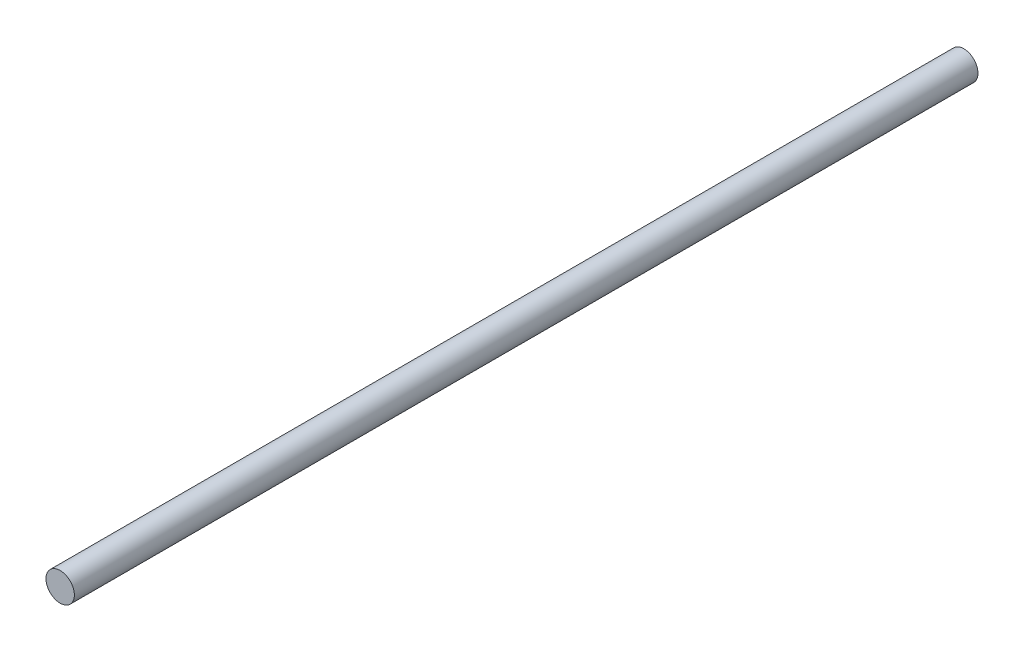
ISO-10303-21;
HEADER;
FILE_DESCRIPTION(('STEP AP214'),'2;1');
FILE_NAME('part.step','',(''),(''),'','','');
FILE_SCHEMA(('AUTOMOTIVE_DESIGN { 1 0 10303 214 1 1 1 1 }'));
ENDSEC;
DATA;
#1=APPLICATION_CONTEXT('core data for automotive mechanical design processes');
#2=APPLICATION_PROTOCOL_DEFINITION('international standard','automotive_design',2000,#1);
#3=PRODUCT_CONTEXT('',#1,'mechanical');
#4=PRODUCT('Part','Part','',(#3));
#5=PRODUCT_RELATED_PRODUCT_CATEGORY('part','',(#4));
#6=PRODUCT_DEFINITION_FORMATION('','',#4);
#7=PRODUCT_DEFINITION_CONTEXT('part definition',#1,'design');
#8=PRODUCT_DEFINITION('design','',#6,#7);
#9=PRODUCT_DEFINITION_SHAPE('','',#8);
#10=(LENGTH_UNIT() NAMED_UNIT(*) SI_UNIT(.MILLI.,.METRE.));
#11=(NAMED_UNIT(*) PLANE_ANGLE_UNIT() SI_UNIT($,.RADIAN.));
#12=(NAMED_UNIT(*) SI_UNIT($,.STERADIAN.) SOLID_ANGLE_UNIT());
#13=UNCERTAINTY_MEASURE_WITH_UNIT(LENGTH_MEASURE(1.E-05),#10,'distance_accuracy_value','');
#14=(GEOMETRIC_REPRESENTATION_CONTEXT(3) GLOBAL_UNCERTAINTY_ASSIGNED_CONTEXT((#13)) GLOBAL_UNIT_ASSIGNED_CONTEXT((#10,
#11,#12)) REPRESENTATION_CONTEXT('',''));
#15=CARTESIAN_POINT('',(0.,0.,0.));
#16=DIRECTION('',(0.,0.,1.));
#17=DIRECTION('',(1.,0.,0.));
#18=AXIS2_PLACEMENT_3D('',#15,#16,#17);
#19=CARTESIAN_POINT('',(0.,0.,254.));
#20=DIRECTION('',(0.,0.,-1.));
#21=DIRECTION('',(-1.,0.,0.));
#22=AXIS2_PLACEMENT_3D('',#19,#20,#21);
#23=CYLINDRICAL_SURFACE('',#22,3.9878);
#24=CARTESIAN_POINT('',(0.,0.,254.));
#25=DIRECTION('',(0.,0.,1.));
#26=DIRECTION('',(1.,0.,0.));
#27=AXIS2_PLACEMENT_3D('',#24,#25,#26);
#28=CIRCLE('',#27,3.9878);
#29=CARTESIAN_POINT('',(3.9878,0.,254.));
#30=VERTEX_POINT('',#29);
#31=EDGE_CURVE('E10',#30,#30,#28,.T.);
#32=ORIENTED_EDGE('',*,*,#31,.F.);
#33=EDGE_LOOP('',(#32));
#34=FACE_BOUND('',#33,.T.);
#35=CARTESIAN_POINT('',(0.,0.,0.));
#36=DIRECTION('',(0.,0.,1.));
#37=DIRECTION('',(1.,0.,0.));
#38=AXIS2_PLACEMENT_3D('',#35,#36,#37);
#39=CIRCLE('',#38,3.9878);
#40=CARTESIAN_POINT('',(3.9878,0.,0.));
#41=VERTEX_POINT('',#40);
#42=EDGE_CURVE('E36',#41,#41,#39,.T.);
#43=ORIENTED_EDGE('',*,*,#42,.T.);
#44=EDGE_LOOP('',(#43));
#45=FACE_BOUND('',#44,.T.);
#46=ADVANCED_FACE('F33',(#34,#45),#23,.T.);
#47=CARTESIAN_POINT('',(0.,0.,254.));
#48=DIRECTION('',(0.,0.,1.));
#49=DIRECTION('',(1.,0.,0.));
#50=AXIS2_PLACEMENT_3D('',#47,#48,#49);
#51=PLANE('',#50);
#52=ORIENTED_EDGE('',*,*,#31,.T.);
#53=EDGE_LOOP('',(#52));
#54=FACE_BOUND('',#53,.T.);
#55=ADVANCED_FACE('F48',(#54),#51,.T.);
#56=CARTESIAN_POINT('',(0.,0.,0.));
#57=DIRECTION('',(0.,0.,1.));
#58=DIRECTION('',(1.,0.,0.));
#59=AXIS2_PLACEMENT_3D('',#56,#57,#58);
#60=PLANE('',#59);
#61=ORIENTED_EDGE('',*,*,#42,.F.);
#62=EDGE_LOOP('',(#61));
#63=FACE_BOUND('',#62,.T.);
#64=ADVANCED_FACE('F46',(#63),#60,.F.);
#65=CLOSED_SHELL('',(#46,#55,#64));
#66=MANIFOLD_SOLID_BREP('B2',#65);
#67=ADVANCED_BREP_SHAPE_REPRESENTATION('',(#18,#66),#14);
#68=SHAPE_DEFINITION_REPRESENTATION(#9,#67);
ENDSEC;
END-ISO-10303-21;
